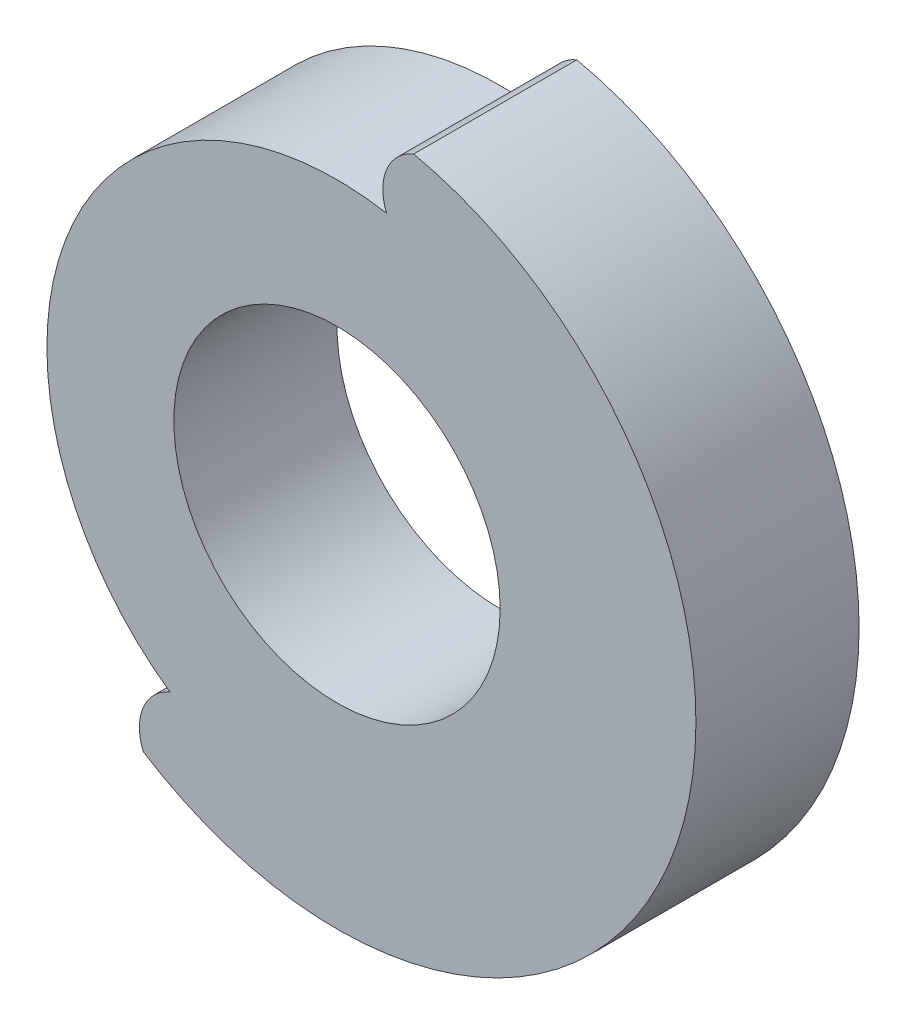
ISO-10303-21;
HEADER;
FILE_DESCRIPTION(('STEP AP214'),'2;1');
FILE_NAME('part.step','',(''),(''),'','','');
FILE_SCHEMA(('AUTOMOTIVE_DESIGN { 1 0 10303 214 1 1 1 1 }'));
ENDSEC;
DATA;
#1=APPLICATION_CONTEXT('core data for automotive mechanical design processes');
#2=APPLICATION_PROTOCOL_DEFINITION('international standard','automotive_design',2000,#1);
#3=PRODUCT_CONTEXT('',#1,'mechanical');
#4=PRODUCT('Part','Part','',(#3));
#5=PRODUCT_RELATED_PRODUCT_CATEGORY('part','',(#4));
#6=PRODUCT_DEFINITION_FORMATION('','',#4);
#7=PRODUCT_DEFINITION_CONTEXT('part definition',#1,'design');
#8=PRODUCT_DEFINITION('design','',#6,#7);
#9=PRODUCT_DEFINITION_SHAPE('','',#8);
#10=(LENGTH_UNIT() NAMED_UNIT(*) SI_UNIT(.MILLI.,.METRE.));
#11=(NAMED_UNIT(*) PLANE_ANGLE_UNIT() SI_UNIT($,.RADIAN.));
#12=(NAMED_UNIT(*) SI_UNIT($,.STERADIAN.) SOLID_ANGLE_UNIT());
#13=UNCERTAINTY_MEASURE_WITH_UNIT(LENGTH_MEASURE(1.E-05),#10,'distance_accuracy_value','');
#14=(GEOMETRIC_REPRESENTATION_CONTEXT(3) GLOBAL_UNCERTAINTY_ASSIGNED_CONTEXT((#13)) GLOBAL_UNIT_ASSIGNED_CONTEXT((#10,
#11,#12)) REPRESENTATION_CONTEXT('',''));
#15=CARTESIAN_POINT('',(0.,0.,0.));
#16=DIRECTION('',(0.,0.,1.));
#17=DIRECTION('',(1.,0.,0.));
#18=AXIS2_PLACEMENT_3D('',#15,#16,#17);
#19=CARTESIAN_POINT('',(0.,0.,6.));
#20=DIRECTION('',(0.,0.,1.));
#21=DIRECTION('',(1.,0.,0.));
#22=AXIS2_PLACEMENT_3D('',#19,#20,#21);
#23=PLANE('',#22);
#24=CARTESIAN_POINT('',(0.,0.,6.));
#25=DIRECTION('',(0.,0.,1.));
#26=DIRECTION('',(1.,0.,0.));
#27=AXIS2_PLACEMENT_3D('',#24,#25,#26);
#28=CIRCLE('',#27,6.);
#29=CARTESIAN_POINT('',(6.,0.,6.));
#30=VERTEX_POINT('',#29);
#31=EDGE_CURVE('E100',#30,#30,#28,.T.);
#32=ORIENTED_EDGE('',*,*,#31,.F.);
#33=EDGE_LOOP('',(#32));
#34=FACE_BOUND('',#33,.T.);
#35=CARTESIAN_POINT('',(0.,0.,6.));
#36=DIRECTION('',(0.,0.,-1.));
#37=DIRECTION('',(-1.,0.,0.));
#38=AXIS2_PLACEMENT_3D('',#35,#36,#37);
#39=CIRCLE('',#38,10.6683645553475);
#40=CARTESIAN_POINT('',(-6.1462773798345,-8.71993558783146,6.));
#41=VERTEX_POINT('',#40);
#42=CARTESIAN_POINT('',(1.81985117133101,10.512,6.));
#43=VERTEX_POINT('',#42);
#44=EDGE_CURVE('E70',#41,#43,#39,.T.);
#45=ORIENTED_EDGE('',*,*,#44,.F.);
#46=CARTESIAN_POINT('',(-5.43917059864794,-10.4051743313833,6.));
#47=DIRECTION('',(0.,0.,-1.));
#48=DIRECTION('',(0.707106781186551,-0.707106781186544,0.));
#49=AXIS2_PLACEMENT_3D('',#46,#47,#48);
#50=CIRCLE('',#49,1.82757479266053);
#51=CARTESIAN_POINT('',(-7.12440934219978,-11.1122811125698,6.));
#52=VERTEX_POINT('',#51);
#53=EDGE_CURVE('E88',#52,#41,#50,.T.);
#54=ORIENTED_EDGE('',*,*,#53,.F.);
#55=CARTESIAN_POINT('',(0.,0.,6.));
#56=DIRECTION('',(0.,0.,1.));
#57=DIRECTION('',(1.,0.,0.));
#58=AXIS2_PLACEMENT_3D('',#55,#56,#57);
#59=CIRCLE('',#58,13.2);
#60=CARTESIAN_POINT('',(2.81985117133101,12.8952874869676,6.));
#61=VERTEX_POINT('',#60);
#62=EDGE_CURVE('E11',#52,#61,#59,.T.);
#63=ORIENTED_EDGE('',*,*,#62,.T.);
#64=CARTESIAN_POINT('',(3.51149491481482,11.2036437434838,6.));
#65=DIRECTION('',(0.,0.,1.));
#66=DIRECTION('',(1.,0.,0.));
#67=AXIS2_PLACEMENT_3D('',#64,#65,#66);
#68=CIRCLE('',#67,1.82757479266053);
#69=EDGE_CURVE('E105',#61,#43,#68,.T.);
#70=ORIENTED_EDGE('',*,*,#69,.T.);
#71=EDGE_LOOP('',(#45,#54,#63,#70));
#72=FACE_BOUND('',#71,.T.);
#73=ADVANCED_FACE('F37',(#34,#72),#23,.T.);
#74=CARTESIAN_POINT('',(0.,0.,0.));
#75=DIRECTION('',(0.,0.,1.));
#76=DIRECTION('',(1.,0.,0.));
#77=AXIS2_PLACEMENT_3D('',#74,#75,#76);
#78=PLANE('',#77);
#79=CARTESIAN_POINT('',(0.,0.,0.));
#80=DIRECTION('',(0.,0.,1.));
#81=DIRECTION('',(1.,0.,0.));
#82=AXIS2_PLACEMENT_3D('',#79,#80,#81);
#83=CIRCLE('',#82,6.);
#84=CARTESIAN_POINT('',(6.,0.,0.));
#85=VERTEX_POINT('',#84);
#86=EDGE_CURVE('E96',#85,#85,#83,.T.);
#87=ORIENTED_EDGE('',*,*,#86,.T.);
#88=EDGE_LOOP('',(#87));
#89=FACE_BOUND('',#88,.T.);
#90=CARTESIAN_POINT('',(-5.43917059864794,-10.4051743313833,0.));
#91=DIRECTION('',(0.,0.,-1.));
#92=DIRECTION('',(0.707106781186551,-0.707106781186544,0.));
#93=AXIS2_PLACEMENT_3D('',#90,#91,#92);
#94=CIRCLE('',#93,1.82757479266053);
#95=CARTESIAN_POINT('',(-7.12440934219978,-11.1122811125698,0.));
#96=VERTEX_POINT('',#95);
#97=CARTESIAN_POINT('',(-6.1462773798345,-8.71993558783146,0.));
#98=VERTEX_POINT('',#97);
#99=EDGE_CURVE('E79',#96,#98,#94,.T.);
#100=ORIENTED_EDGE('',*,*,#99,.T.);
#101=CARTESIAN_POINT('',(0.,0.,0.));
#102=DIRECTION('',(0.,0.,-1.));
#103=DIRECTION('',(-1.,0.,0.));
#104=AXIS2_PLACEMENT_3D('',#101,#102,#103);
#105=CIRCLE('',#104,10.6683645553475);
#106=CARTESIAN_POINT('',(1.81985117133101,10.512,0.));
#107=VERTEX_POINT('',#106);
#108=EDGE_CURVE('E213',#98,#107,#105,.T.);
#109=ORIENTED_EDGE('',*,*,#108,.T.);
#110=CARTESIAN_POINT('',(3.51149491481482,11.2036437434838,0.));
#111=DIRECTION('',(0.,0.,1.));
#112=DIRECTION('',(1.,0.,0.));
#113=AXIS2_PLACEMENT_3D('',#110,#111,#112);
#114=CIRCLE('',#113,1.82757479266053);
#115=CARTESIAN_POINT('',(2.81985117133101,12.8952874869676,0.));
#116=VERTEX_POINT('',#115);
#117=EDGE_CURVE('E102',#116,#107,#114,.T.);
#118=ORIENTED_EDGE('',*,*,#117,.F.);
#119=CARTESIAN_POINT('',(0.,0.,0.));
#120=DIRECTION('',(0.,0.,1.));
#121=DIRECTION('',(1.,0.,0.));
#122=AXIS2_PLACEMENT_3D('',#119,#120,#121);
#123=CIRCLE('',#122,13.2);
#124=EDGE_CURVE('E41',#96,#116,#123,.T.);
#125=ORIENTED_EDGE('',*,*,#124,.F.);
#126=EDGE_LOOP('',(#100,#109,#118,#125));
#127=FACE_BOUND('',#126,.T.);
#128=ADVANCED_FACE('F115',(#89,#127),#78,.F.);
#129=CARTESIAN_POINT('',(0.,0.,6.));
#130=DIRECTION('',(0.,0.,-1.));
#131=DIRECTION('',(-1.,0.,0.));
#132=AXIS2_PLACEMENT_3D('',#129,#130,#131);
#133=CYLINDRICAL_SURFACE('',#132,13.2);
#134=ORIENTED_EDGE('',*,*,#62,.F.);
#135=DIRECTION('',(0.,0.,1.));
#136=VECTOR('',#135,1.);
#137=CARTESIAN_POINT('',(-7.12440934219978,-11.1122811125698,0.));
#138=LINE('',#137,#136);
#139=EDGE_CURVE('E86',#96,#52,#138,.T.);
#140=ORIENTED_EDGE('',*,*,#139,.F.);
#141=ORIENTED_EDGE('',*,*,#124,.T.);
#142=DIRECTION('',(0.,0.,1.));
#143=VECTOR('',#142,1.);
#144=CARTESIAN_POINT('',(2.81985117133101,12.8952874869676,0.));
#145=LINE('',#144,#143);
#146=EDGE_CURVE('E92',#116,#61,#145,.T.);
#147=ORIENTED_EDGE('',*,*,#146,.T.);
#148=EDGE_LOOP('',(#134,#140,#141,#147));
#149=FACE_BOUND('',#148,.T.);
#150=ADVANCED_FACE('F39',(#149),#133,.T.);
#151=CARTESIAN_POINT('',(0.,0.,6.));
#152=DIRECTION('',(0.,0.,-1.));
#153=DIRECTION('',(-1.,0.,0.));
#154=AXIS2_PLACEMENT_3D('',#151,#152,#153);
#155=CYLINDRICAL_SURFACE('',#154,6.);
#156=ORIENTED_EDGE('',*,*,#31,.T.);
#157=EDGE_LOOP('',(#156));
#158=FACE_BOUND('',#157,.T.);
#159=ORIENTED_EDGE('',*,*,#86,.F.);
#160=EDGE_LOOP('',(#159));
#161=FACE_BOUND('',#160,.T.);
#162=ADVANCED_FACE('F111',(#158,#161),#155,.F.);
#163=CARTESIAN_POINT('',(3.51149491481482,11.2036437434838,0.));
#164=DIRECTION('',(0.,0.,1.));
#165=DIRECTION('',(1.,0.,0.));
#166=AXIS2_PLACEMENT_3D('',#163,#164,#165);
#167=CYLINDRICAL_SURFACE('',#166,1.82757479266053);
#168=ORIENTED_EDGE('',*,*,#69,.F.);
#169=ORIENTED_EDGE('',*,*,#146,.F.);
#170=ORIENTED_EDGE('',*,*,#117,.T.);
#171=DIRECTION('',(0.,0.,1.));
#172=VECTOR('',#171,1.);
#173=CARTESIAN_POINT('',(1.81985117133101,10.512,0.));
#174=LINE('',#173,#172);
#175=EDGE_CURVE('E97',#107,#43,#174,.T.);
#176=ORIENTED_EDGE('',*,*,#175,.T.);
#177=EDGE_LOOP('',(#168,#169,#170,#176));
#178=FACE_BOUND('',#177,.T.);
#179=ADVANCED_FACE('F124',(#178),#167,.T.);
#180=CARTESIAN_POINT('',(0.,0.,0.));
#181=DIRECTION('',(0.,0.,1.));
#182=DIRECTION('',(1.,0.,0.));
#183=AXIS2_PLACEMENT_3D('',#180,#181,#182);
#184=CYLINDRICAL_SURFACE('',#183,10.6683645553475);
#185=ORIENTED_EDGE('',*,*,#44,.T.);
#186=ORIENTED_EDGE('',*,*,#175,.F.);
#187=ORIENTED_EDGE('',*,*,#108,.F.);
#188=DIRECTION('',(0.,0.,1.));
#189=VECTOR('',#188,1.);
#190=CARTESIAN_POINT('',(-6.1462773798345,-8.71993558783146,0.));
#191=LINE('',#190,#189);
#192=EDGE_CURVE('E89',#98,#41,#191,.T.);
#193=ORIENTED_EDGE('',*,*,#192,.T.);
#194=EDGE_LOOP('',(#185,#186,#187,#193));
#195=FACE_BOUND('',#194,.T.);
#196=ADVANCED_FACE('F125',(#195),#184,.T.);
#197=CARTESIAN_POINT('',(-5.43917059864794,-10.4051743313833,0.));
#198=DIRECTION('',(0.,0.,1.));
#199=DIRECTION('',(1.,0.,0.));
#200=AXIS2_PLACEMENT_3D('',#197,#198,#199);
#201=CYLINDRICAL_SURFACE('',#200,1.82757479266053);
#202=ORIENTED_EDGE('',*,*,#53,.T.);
#203=ORIENTED_EDGE('',*,*,#192,.F.);
#204=ORIENTED_EDGE('',*,*,#99,.F.);
#205=ORIENTED_EDGE('',*,*,#139,.T.);
#206=EDGE_LOOP('',(#202,#203,#204,#205));
#207=FACE_BOUND('',#206,.T.);
#208=ADVANCED_FACE('F87',(#207),#201,.T.);
#209=CLOSED_SHELL('',(#73,#128,#150,#162,#179,#196,#208));
#210=MANIFOLD_SOLID_BREP('B2',#209);
#211=ADVANCED_BREP_SHAPE_REPRESENTATION('',(#18,#210),#14);
#212=SHAPE_DEFINITION_REPRESENTATION(#9,#211);
ENDSEC;
END-ISO-10303-21;
